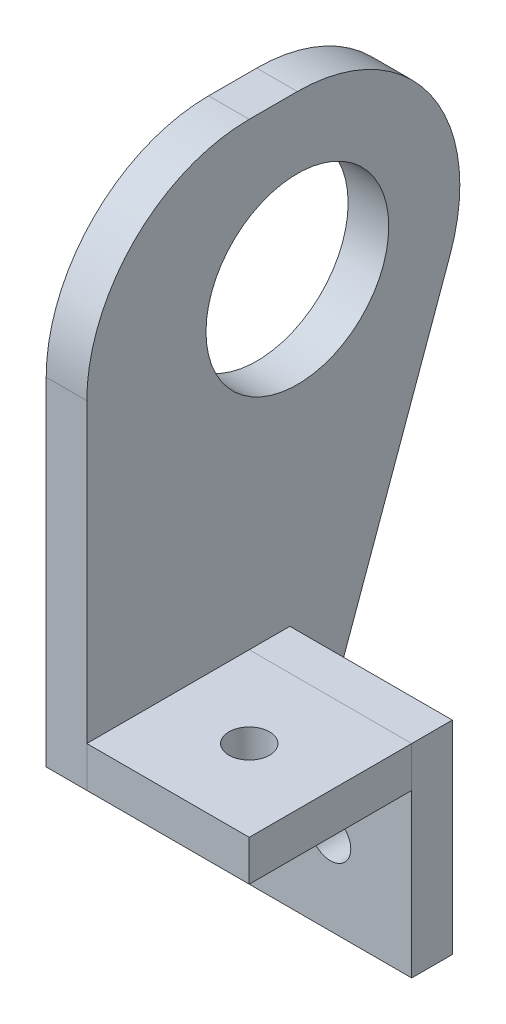
ISO-10303-21;
HEADER;
FILE_DESCRIPTION(('STEP AP214'),'2;1');
FILE_NAME('part.step','',(''),(''),'','','');
FILE_SCHEMA(('AUTOMOTIVE_DESIGN { 1 0 10303 214 1 1 1 1 }'));
ENDSEC;
DATA;
#1=APPLICATION_CONTEXT('core data for automotive mechanical design processes');
#2=APPLICATION_PROTOCOL_DEFINITION('international standard','automotive_design',2000,#1);
#3=PRODUCT_CONTEXT('',#1,'mechanical');
#4=PRODUCT('Part','Part','',(#3));
#5=PRODUCT_RELATED_PRODUCT_CATEGORY('part','',(#4));
#6=PRODUCT_DEFINITION_FORMATION('','',#4);
#7=PRODUCT_DEFINITION_CONTEXT('part definition',#1,'design');
#8=PRODUCT_DEFINITION('design','',#6,#7);
#9=PRODUCT_DEFINITION_SHAPE('','',#8);
#10=(LENGTH_UNIT() NAMED_UNIT(*) SI_UNIT(.MILLI.,.METRE.));
#11=(NAMED_UNIT(*) PLANE_ANGLE_UNIT() SI_UNIT($,.RADIAN.));
#12=(NAMED_UNIT(*) SI_UNIT($,.STERADIAN.) SOLID_ANGLE_UNIT());
#13=UNCERTAINTY_MEASURE_WITH_UNIT(LENGTH_MEASURE(1.E-05),#10,'distance_accuracy_value','');
#14=(GEOMETRIC_REPRESENTATION_CONTEXT(3) GLOBAL_UNCERTAINTY_ASSIGNED_CONTEXT((#13)) GLOBAL_UNIT_ASSIGNED_CONTEXT((#10,
#11,#12)) REPRESENTATION_CONTEXT('',''));
#15=CARTESIAN_POINT('',(0.,0.,0.));
#16=DIRECTION('',(0.,0.,1.));
#17=DIRECTION('',(1.,0.,0.));
#18=AXIS2_PLACEMENT_3D('',#15,#16,#17);
#19=CARTESIAN_POINT('',(31.75,-78.1749999999953,1.17499999999981));
#20=DIRECTION('',(0.,0.,1.));
#21=DIRECTION('',(1.,0.,0.));
#22=AXIS2_PLACEMENT_3D('',#19,#20,#21);
#23=PLANE('',#22);
#24=CARTESIAN_POINT('',(19.05,-65.4749999999953,1.17499999999981));
#25=DIRECTION('',(0.,0.,1.));
#26=DIRECTION('',(1.,0.,0.));
#27=AXIS2_PLACEMENT_3D('',#24,#25,#26);
#28=CIRCLE('',#27,3.175);
#29=CARTESIAN_POINT('',(22.225,-65.4749999999953,1.17499999999981));
#30=VERTEX_POINT('',#29);
#31=EDGE_CURVE('E113',#30,#30,#28,.T.);
#32=ORIENTED_EDGE('',*,*,#31,.T.);
#33=EDGE_LOOP('',(#32));
#34=FACE_BOUND('',#33,.T.);
#35=DIRECTION('',(0.,1.,0.));
#36=VECTOR('',#35,1.);
#37=CARTESIAN_POINT('',(6.35,-78.1749999999953,1.17499999999981));
#38=LINE('',#37,#36);
#39=CARTESIAN_POINT('',(6.35,-78.1749999999953,1.17499999999981));
#40=VERTEX_POINT('',#39);
#41=CARTESIAN_POINT('',(6.35,-46.4249999999953,1.17499999999981));
#42=VERTEX_POINT('',#41);
#43=EDGE_CURVE('E110',#40,#42,#38,.T.);
#44=ORIENTED_EDGE('',*,*,#43,.T.);
#45=DIRECTION('',(-1.,0.,0.));
#46=VECTOR('',#45,1.);
#47=CARTESIAN_POINT('',(31.75,-46.4249999999953,1.17499999999981));
#48=LINE('',#47,#46);
#49=CARTESIAN_POINT('',(31.75,-46.4249999999953,1.17499999999981));
#50=VERTEX_POINT('',#49);
#51=EDGE_CURVE('E12',#50,#42,#48,.T.);
#52=ORIENTED_EDGE('',*,*,#51,.F.);
#53=DIRECTION('',(0.,1.,0.));
#54=VECTOR('',#53,1.);
#55=CARTESIAN_POINT('',(31.75,-78.1749999999953,1.17499999999981));
#56=LINE('',#55,#54);
#57=CARTESIAN_POINT('',(31.75,-78.1749999999953,1.17499999999981));
#58=VERTEX_POINT('',#57);
#59=EDGE_CURVE('E98',#58,#50,#56,.T.);
#60=ORIENTED_EDGE('',*,*,#59,.F.);
#61=DIRECTION('',(-1.,0.,0.));
#62=VECTOR('',#61,1.);
#63=CARTESIAN_POINT('',(31.75,-78.1749999999953,1.17499999999981));
#64=LINE('',#63,#62);
#65=EDGE_CURVE('E106',#58,#40,#64,.T.);
#66=ORIENTED_EDGE('',*,*,#65,.T.);
#67=EDGE_LOOP('',(#44,#52,#60,#66));
#68=FACE_BOUND('',#67,.T.);
#69=ADVANCED_FACE('F47',(#34,#68),#23,.F.);
#70=CARTESIAN_POINT('',(31.75,-46.4249999999953,1.17499999999981));
#71=DIRECTION('',(0.,-1.,0.));
#72=DIRECTION('',(0.,0.,-1.));
#73=AXIS2_PLACEMENT_3D('',#70,#71,#72);
#74=PLANE('',#73);
#75=DIRECTION('',(0.,0.,1.));
#76=VECTOR('',#75,1.);
#77=CARTESIAN_POINT('',(6.35,-46.4249999999953,1.17499999999981));
#78=LINE('',#77,#76);
#79=CARTESIAN_POINT('',(6.35,-46.4249999999953,7.52499999999958));
#80=VERTEX_POINT('',#79);
#81=EDGE_CURVE('E102',#42,#80,#78,.T.);
#82=ORIENTED_EDGE('',*,*,#81,.T.);
#83=DIRECTION('',(-1.,0.,0.));
#84=VECTOR('',#83,1.);
#85=CARTESIAN_POINT('',(31.75,-46.4249999999953,7.52499999999958));
#86=LINE('',#85,#84);
#87=CARTESIAN_POINT('',(31.75,-46.4249999999953,7.52499999999958));
#88=VERTEX_POINT('',#87);
#89=EDGE_CURVE('E55',#88,#80,#86,.T.);
#90=ORIENTED_EDGE('',*,*,#89,.F.);
#91=DIRECTION('',(0.,0.,1.));
#92=VECTOR('',#91,1.);
#93=CARTESIAN_POINT('',(31.75,-46.4249999999953,1.17499999999981));
#94=LINE('',#93,#92);
#95=EDGE_CURVE('E93',#50,#88,#94,.T.);
#96=ORIENTED_EDGE('',*,*,#95,.F.);
#97=ORIENTED_EDGE('',*,*,#51,.T.);
#98=EDGE_LOOP('',(#82,#90,#96,#97));
#99=FACE_BOUND('',#98,.T.);
#100=ADVANCED_FACE('F101',(#99),#74,.F.);
#101=CARTESIAN_POINT('',(31.75,-78.1749999999953,7.52499999999958));
#102=DIRECTION('',(0.,0.,-1.));
#103=DIRECTION('',(-1.,0.,0.));
#104=AXIS2_PLACEMENT_3D('',#101,#102,#103);
#105=PLANE('',#104);
#106=CARTESIAN_POINT('',(19.05,-65.4749999999953,7.52499999999958));
#107=DIRECTION('',(0.,0.,1.));
#108=DIRECTION('',(1.,0.,0.));
#109=AXIS2_PLACEMENT_3D('',#106,#107,#108);
#110=CIRCLE('',#109,3.175);
#111=CARTESIAN_POINT('',(22.225,-65.4749999999953,7.52499999999958));
#112=VERTEX_POINT('',#111);
#113=EDGE_CURVE('E126',#112,#112,#110,.T.);
#114=ORIENTED_EDGE('',*,*,#113,.F.);
#115=EDGE_LOOP('',(#114));
#116=FACE_BOUND('',#115,.T.);
#117=DIRECTION('',(0.,-1.,0.));
#118=VECTOR('',#117,1.);
#119=CARTESIAN_POINT('',(6.35,-78.1749999999953,7.52499999999958));
#120=LINE('',#119,#118);
#121=CARTESIAN_POINT('',(6.35,-78.1749999999953,7.52499999999958));
#122=VERTEX_POINT('',#121);
#123=EDGE_CURVE('E80',#80,#122,#120,.T.);
#124=ORIENTED_EDGE('',*,*,#123,.T.);
#125=DIRECTION('',(-1.,0.,0.));
#126=VECTOR('',#125,1.);
#127=CARTESIAN_POINT('',(31.75,-78.1749999999953,7.52499999999958));
#128=LINE('',#127,#126);
#129=CARTESIAN_POINT('',(31.75,-78.1749999999953,7.52499999999958));
#130=VERTEX_POINT('',#129);
#131=EDGE_CURVE('E103',#130,#122,#128,.T.);
#132=ORIENTED_EDGE('',*,*,#131,.F.);
#133=DIRECTION('',(0.,-1.,0.));
#134=VECTOR('',#133,1.);
#135=CARTESIAN_POINT('',(31.75,-78.1749999999953,7.52499999999958));
#136=LINE('',#135,#134);
#137=EDGE_CURVE('E96',#88,#130,#136,.T.);
#138=ORIENTED_EDGE('',*,*,#137,.F.);
#139=ORIENTED_EDGE('',*,*,#89,.T.);
#140=EDGE_LOOP('',(#124,#132,#138,#139));
#141=FACE_BOUND('',#140,.T.);
#142=ADVANCED_FACE('F104',(#116,#141),#105,.F.);
#143=CARTESIAN_POINT('',(31.75,-78.1749999999953,1.17499999999981));
#144=DIRECTION('',(0.,1.,0.));
#145=DIRECTION('',(0.,0.,1.));
#146=AXIS2_PLACEMENT_3D('',#143,#144,#145);
#147=PLANE('',#146);
#148=DIRECTION('',(0.,0.,-1.));
#149=VECTOR('',#148,1.);
#150=CARTESIAN_POINT('',(6.35,-78.1749999999953,1.17499999999981));
#151=LINE('',#150,#149);
#152=EDGE_CURVE('E86',#122,#40,#151,.T.);
#153=ORIENTED_EDGE('',*,*,#152,.T.);
#154=ORIENTED_EDGE('',*,*,#65,.F.);
#155=DIRECTION('',(0.,0.,-1.));
#156=VECTOR('',#155,1.);
#157=CARTESIAN_POINT('',(31.75,-78.1749999999953,1.17499999999981));
#158=LINE('',#157,#156);
#159=EDGE_CURVE('E63',#130,#58,#158,.T.);
#160=ORIENTED_EDGE('',*,*,#159,.F.);
#161=ORIENTED_EDGE('',*,*,#131,.T.);
#162=EDGE_LOOP('',(#153,#154,#160,#161));
#163=FACE_BOUND('',#162,.T.);
#164=ADVANCED_FACE('F118',(#163),#147,.F.);
#165=CARTESIAN_POINT('',(31.75,0.,0.));
#166=DIRECTION('',(1.,0.,0.));
#167=DIRECTION('',(0.,0.,-1.));
#168=AXIS2_PLACEMENT_3D('',#165,#166,#167);
#169=PLANE('',#168);
#170=ORIENTED_EDGE('',*,*,#59,.T.);
#171=ORIENTED_EDGE('',*,*,#95,.T.);
#172=ORIENTED_EDGE('',*,*,#137,.T.);
#173=ORIENTED_EDGE('',*,*,#159,.T.);
#174=EDGE_LOOP('',(#170,#171,#172,#173));
#175=FACE_BOUND('',#174,.T.);
#176=ADVANCED_FACE('F94',(#175),#169,.T.);
#177=CARTESIAN_POINT('',(6.35,0.,0.));
#178=DIRECTION('',(1.,0.,0.));
#179=DIRECTION('',(0.,0.,-1.));
#180=AXIS2_PLACEMENT_3D('',#177,#178,#179);
#181=PLANE('',#180);
#182=ORIENTED_EDGE('',*,*,#43,.F.);
#183=ORIENTED_EDGE('',*,*,#152,.F.);
#184=ORIENTED_EDGE('',*,*,#123,.F.);
#185=ORIENTED_EDGE('',*,*,#81,.F.);
#186=EDGE_LOOP('',(#182,#183,#184,#185));
#187=FACE_BOUND('',#186,.T.);
#188=ADVANCED_FACE('F121',(#187),#181,.F.);
#189=CARTESIAN_POINT('',(19.05,-65.4749999999953,-25.4));
#190=DIRECTION('',(0.,0.,1.));
#191=DIRECTION('',(1.,0.,0.));
#192=AXIS2_PLACEMENT_3D('',#189,#190,#191);
#193=CYLINDRICAL_SURFACE('',#192,3.175);
#194=ORIENTED_EDGE('',*,*,#113,.T.);
#195=EDGE_LOOP('',(#194));
#196=FACE_BOUND('',#195,.T.);
#197=ORIENTED_EDGE('',*,*,#31,.F.);
#198=EDGE_LOOP('',(#197));
#199=FACE_BOUND('',#198,.T.);
#200=ADVANCED_FACE('F130',(#196,#199),#193,.F.);
#201=CLOSED_SHELL('',(#69,#100,#142,#164,#176,#188,#200));
#202=MANIFOLD_SOLID_BREP('B2',#201);
#203=CARTESIAN_POINT('',(31.75,-52.7749999999953,32.9249999999998));
#204=DIRECTION('',(0.,0.,-1.));
#205=DIRECTION('',(-1.,0.,0.));
#206=AXIS2_PLACEMENT_3D('',#203,#204,#205);
#207=PLANE('',#206);
#208=DIRECTION('',(0.,-1.,0.));
#209=VECTOR('',#208,1.);
#210=CARTESIAN_POINT('',(6.35,-52.7749999999953,32.9249999999998));
#211=LINE('',#210,#209);
#212=CARTESIAN_POINT('',(6.35,-46.4249999999953,32.9249999999998));
#213=VERTEX_POINT('',#212);
#214=CARTESIAN_POINT('',(6.35,-52.7749999999953,32.9249999999998));
#215=VERTEX_POINT('',#214);
#216=EDGE_CURVE('E251',#213,#215,#211,.T.);
#217=ORIENTED_EDGE('',*,*,#216,.T.);
#218=DIRECTION('',(-1.,0.,0.));
#219=VECTOR('',#218,1.);
#220=CARTESIAN_POINT('',(31.75,-52.7749999999953,32.9249999999998));
#221=LINE('',#220,#219);
#222=CARTESIAN_POINT('',(31.75,-52.7749999999953,32.9249999999998));
#223=VERTEX_POINT('',#222);
#224=EDGE_CURVE('E45',#223,#215,#221,.T.);
#225=ORIENTED_EDGE('',*,*,#224,.F.);
#226=DIRECTION('',(0.,-1.,0.));
#227=VECTOR('',#226,1.);
#228=CARTESIAN_POINT('',(31.75,-52.7749999999953,32.9249999999998));
#229=LINE('',#228,#227);
#230=CARTESIAN_POINT('',(31.75,-46.4249999999953,32.9249999999998));
#231=VERTEX_POINT('',#230);
#232=EDGE_CURVE('E238',#231,#223,#229,.T.);
#233=ORIENTED_EDGE('',*,*,#232,.F.);
#234=DIRECTION('',(-1.,0.,0.));
#235=VECTOR('',#234,1.);
#236=CARTESIAN_POINT('',(31.75,-46.4249999999953,32.9249999999998));
#237=LINE('',#236,#235);
#238=EDGE_CURVE('E247',#231,#213,#237,.T.);
#239=ORIENTED_EDGE('',*,*,#238,.T.);
#240=EDGE_LOOP('',(#217,#225,#233,#239));
#241=FACE_BOUND('',#240,.T.);
#242=ADVANCED_FACE('F186',(#241),#207,.F.);
#243=CARTESIAN_POINT('',(31.75,-52.7749999999953,32.9249999999998));
#244=DIRECTION('',(0.,1.,0.));
#245=DIRECTION('',(0.,0.,1.));
#246=AXIS2_PLACEMENT_3D('',#243,#244,#245);
#247=PLANE('',#246);
#248=CARTESIAN_POINT('',(19.05,-52.7749999999953,20.2249999999997));
#249=DIRECTION('',(0.,-1.,0.));
#250=DIRECTION('',(0.,0.,-1.));
#251=AXIS2_PLACEMENT_3D('',#248,#249,#250);
#252=CIRCLE('',#251,3.175);
#253=CARTESIAN_POINT('',(19.05,-52.7749999999953,17.0499999999997));
#254=VERTEX_POINT('',#253);
#255=EDGE_CURVE('E264',#254,#254,#252,.T.);
#256=ORIENTED_EDGE('',*,*,#255,.F.);
#257=EDGE_LOOP('',(#256));
#258=FACE_BOUND('',#257,.T.);
#259=DIRECTION('',(0.,0.,-1.));
#260=VECTOR('',#259,1.);
#261=CARTESIAN_POINT('',(6.35,-52.7749999999953,32.9249999999998));
#262=LINE('',#261,#260);
#263=CARTESIAN_POINT('',(6.35,-52.7749999999953,7.52499999999958));
#264=VERTEX_POINT('',#263);
#265=EDGE_CURVE('E242',#215,#264,#262,.T.);
#266=ORIENTED_EDGE('',*,*,#265,.T.);
#267=DIRECTION('',(-1.,0.,0.));
#268=VECTOR('',#267,1.);
#269=CARTESIAN_POINT('',(31.75,-52.7749999999953,7.52499999999958));
#270=LINE('',#269,#268);
#271=CARTESIAN_POINT('',(31.75,-52.7749999999953,7.52499999999958));
#272=VERTEX_POINT('',#271);
#273=EDGE_CURVE('E195',#272,#264,#270,.T.);
#274=ORIENTED_EDGE('',*,*,#273,.F.);
#275=DIRECTION('',(0.,0.,-1.));
#276=VECTOR('',#275,1.);
#277=CARTESIAN_POINT('',(31.75,-52.7749999999953,32.9249999999998));
#278=LINE('',#277,#276);
#279=EDGE_CURVE('E233',#223,#272,#278,.T.);
#280=ORIENTED_EDGE('',*,*,#279,.F.);
#281=ORIENTED_EDGE('',*,*,#224,.T.);
#282=EDGE_LOOP('',(#266,#274,#280,#281));
#283=FACE_BOUND('',#282,.T.);
#284=ADVANCED_FACE('F241',(#258,#283),#247,.F.);
#285=CARTESIAN_POINT('',(31.75,-52.7749999999953,7.52499999999958));
#286=DIRECTION('',(0.,0.,1.));
#287=DIRECTION('',(1.,0.,0.));
#288=AXIS2_PLACEMENT_3D('',#285,#286,#287);
#289=PLANE('',#288);
#290=DIRECTION('',(0.,1.,0.));
#291=VECTOR('',#290,1.);
#292=CARTESIAN_POINT('',(6.35,-52.7749999999953,7.52499999999958));
#293=LINE('',#292,#291);
#294=CARTESIAN_POINT('',(6.35,-46.4249999999953,7.52499999999958));
#295=VERTEX_POINT('',#294);
#296=EDGE_CURVE('E220',#264,#295,#293,.T.);
#297=ORIENTED_EDGE('',*,*,#296,.T.);
#298=DIRECTION('',(-1.,0.,0.));
#299=VECTOR('',#298,1.);
#300=CARTESIAN_POINT('',(31.75,-46.4249999999953,7.52499999999958));
#301=LINE('',#300,#299);
#302=CARTESIAN_POINT('',(31.75,-46.4249999999953,7.52499999999958));
#303=VERTEX_POINT('',#302);
#304=EDGE_CURVE('E243',#303,#295,#301,.T.);
#305=ORIENTED_EDGE('',*,*,#304,.F.);
#306=DIRECTION('',(0.,1.,0.));
#307=VECTOR('',#306,1.);
#308=CARTESIAN_POINT('',(31.75,-52.7749999999953,7.52499999999958));
#309=LINE('',#308,#307);
#310=EDGE_CURVE('E236',#272,#303,#309,.T.);
#311=ORIENTED_EDGE('',*,*,#310,.F.);
#312=ORIENTED_EDGE('',*,*,#273,.T.);
#313=EDGE_LOOP('',(#297,#305,#311,#312));
#314=FACE_BOUND('',#313,.T.);
#315=ADVANCED_FACE('F245',(#314),#289,.F.);
#316=CARTESIAN_POINT('',(31.75,-46.4249999999953,32.9249999999998));
#317=DIRECTION('',(0.,-1.,0.));
#318=DIRECTION('',(0.,0.,-1.));
#319=AXIS2_PLACEMENT_3D('',#316,#317,#318);
#320=PLANE('',#319);
#321=CARTESIAN_POINT('',(19.05,-46.4249999999953,20.2249999999997));
#322=DIRECTION('',(0.,-1.,0.));
#323=DIRECTION('',(0.,0.,-1.));
#324=AXIS2_PLACEMENT_3D('',#321,#322,#323);
#325=CIRCLE('',#324,3.175);
#326=CARTESIAN_POINT('',(19.05,-46.4249999999953,17.0499999999997));
#327=VERTEX_POINT('',#326);
#328=EDGE_CURVE('E189',#327,#327,#325,.T.);
#329=ORIENTED_EDGE('',*,*,#328,.T.);
#330=EDGE_LOOP('',(#329));
#331=FACE_BOUND('',#330,.T.);
#332=DIRECTION('',(0.,0.,1.));
#333=VECTOR('',#332,1.);
#334=CARTESIAN_POINT('',(6.35,-46.4249999999953,32.9249999999998));
#335=LINE('',#334,#333);
#336=EDGE_CURVE('E226',#295,#213,#335,.T.);
#337=ORIENTED_EDGE('',*,*,#336,.T.);
#338=ORIENTED_EDGE('',*,*,#238,.F.);
#339=DIRECTION('',(0.,0.,1.));
#340=VECTOR('',#339,1.);
#341=CARTESIAN_POINT('',(31.75,-46.4249999999953,32.9249999999998));
#342=LINE('',#341,#340);
#343=EDGE_CURVE('E203',#303,#231,#342,.T.);
#344=ORIENTED_EDGE('',*,*,#343,.F.);
#345=ORIENTED_EDGE('',*,*,#304,.T.);
#346=EDGE_LOOP('',(#337,#338,#344,#345));
#347=FACE_BOUND('',#346,.T.);
#348=ADVANCED_FACE('F258',(#331,#347),#320,.F.);
#349=CARTESIAN_POINT('',(31.75,0.,0.));
#350=DIRECTION('',(-1.,0.,0.));
#351=DIRECTION('',(0.,0.,1.));
#352=AXIS2_PLACEMENT_3D('',#349,#350,#351);
#353=PLANE('',#352);
#354=ORIENTED_EDGE('',*,*,#232,.T.);
#355=ORIENTED_EDGE('',*,*,#279,.T.);
#356=ORIENTED_EDGE('',*,*,#310,.T.);
#357=ORIENTED_EDGE('',*,*,#343,.T.);
#358=EDGE_LOOP('',(#354,#355,#356,#357));
#359=FACE_BOUND('',#358,.T.);
#360=ADVANCED_FACE('F234',(#359),#353,.F.);
#361=CARTESIAN_POINT('',(6.35,0.,0.));
#362=DIRECTION('',(-1.,0.,0.));
#363=DIRECTION('',(0.,0.,1.));
#364=AXIS2_PLACEMENT_3D('',#361,#362,#363);
#365=PLANE('',#364);
#366=ORIENTED_EDGE('',*,*,#216,.F.);
#367=ORIENTED_EDGE('',*,*,#336,.F.);
#368=ORIENTED_EDGE('',*,*,#296,.F.);
#369=ORIENTED_EDGE('',*,*,#265,.F.);
#370=EDGE_LOOP('',(#366,#367,#368,#369));
#371=FACE_BOUND('',#370,.T.);
#372=ADVANCED_FACE('F261',(#371),#365,.T.);
#373=CARTESIAN_POINT('',(19.05,25.4,20.2249999999997));
#374=DIRECTION('',(0.,-1.,0.));
#375=DIRECTION('',(0.,0.,-1.));
#376=AXIS2_PLACEMENT_3D('',#373,#374,#375);
#377=CYLINDRICAL_SURFACE('',#376,3.175);
#378=ORIENTED_EDGE('',*,*,#255,.T.);
#379=EDGE_LOOP('',(#378));
#380=FACE_BOUND('',#379,.T.);
#381=ORIENTED_EDGE('',*,*,#328,.F.);
#382=EDGE_LOOP('',(#381));
#383=FACE_BOUND('',#382,.T.);
#384=ADVANCED_FACE('F272',(#380,#383),#377,.F.);
#385=CLOSED_SHELL('',(#242,#284,#315,#348,#360,#372,#384));
#386=MANIFOLD_SOLID_BREP('B6',#385);
#387=CARTESIAN_POINT('',(6.35,-54.3624999999953,9.11249999999958));
#388=DIRECTION('',(1.,0.,0.));
#389=DIRECTION('',(0.,0.,-1.));
#390=AXIS2_PLACEMENT_3D('',#387,#388,#389);
#391=PLANE('',#390);
#392=DIRECTION('',(0.,0.,1.));
#393=VECTOR('',#392,1.);
#394=CARTESIAN_POINT('',(6.35,25.4,0.));
#395=LINE('',#394,#393);
#396=CARTESIAN_POINT('',(6.35,25.4,0.));
#397=VERTEX_POINT('',#396);
#398=CARTESIAN_POINT('',(6.35,25.4,7.52499999999982));
#399=VERTEX_POINT('',#398);
#400=EDGE_CURVE('E451',#397,#399,#395,.T.);
#401=ORIENTED_EDGE('',*,*,#400,.T.);
#402=CARTESIAN_POINT('',(6.35,0.,7.52499999999981));
#403=DIRECTION('',(1.,0.,0.));
#404=DIRECTION('',(0.,0.,-1.));
#405=AXIS2_PLACEMENT_3D('',#402,#403,#404);
#406=CIRCLE('',#405,25.4);
#407=CARTESIAN_POINT('',(6.35,0.,32.9249999999998));
#408=VERTEX_POINT('',#407);
#409=EDGE_CURVE('E184',#399,#408,#406,.T.);
#410=ORIENTED_EDGE('',*,*,#409,.T.);
#411=DIRECTION('',(0.,-1.,0.));
#412=VECTOR('',#411,1.);
#413=CARTESIAN_POINT('',(6.35,25.4,32.9249999999998));
#414=LINE('',#413,#412);
#415=CARTESIAN_POINT('',(6.35,-52.7749999999953,32.9249999999998));
#416=VERTEX_POINT('',#415);
#417=EDGE_CURVE('E449',#408,#416,#414,.T.);
#418=ORIENTED_EDGE('',*,*,#417,.T.);
#419=DIRECTION('',(0.,0.,-1.));
#420=VECTOR('',#419,1.);
#421=CARTESIAN_POINT('',(6.35,-52.7749999999953,9.11249999999959));
#422=LINE('',#421,#420);
#423=CARTESIAN_POINT('',(6.35,-52.7749999999953,9.11249999999959));
#424=VERTEX_POINT('',#423);
#425=EDGE_CURVE('E403',#416,#424,#422,.T.);
#426=ORIENTED_EDGE('',*,*,#425,.T.);
#427=CARTESIAN_POINT('',(6.35,-54.3624999999953,9.11249999999958));
#428=DIRECTION('',(-1.,0.,0.));
#429=DIRECTION('',(0.,0.,-1.));
#430=AXIS2_PLACEMENT_3D('',#427,#428,#429);
#431=CIRCLE('',#430,1.5875);
#432=CARTESIAN_POINT('',(6.35,-54.3624999999953,7.52499999999958));
#433=VERTEX_POINT('',#432);
#434=EDGE_CURVE('E398',#424,#433,#431,.T.);
#435=ORIENTED_EDGE('',*,*,#434,.T.);
#436=DIRECTION('',(0.,-1.,0.));
#437=VECTOR('',#436,1.);
#438=CARTESIAN_POINT('',(6.35,-78.1749999999953,7.52499999999958));
#439=LINE('',#438,#437);
#440=CARTESIAN_POINT('',(6.35,-78.1749999999953,7.52499999999958));
#441=VERTEX_POINT('',#440);
#442=EDGE_CURVE('E387',#433,#441,#439,.T.);
#443=ORIENTED_EDGE('',*,*,#442,.T.);
#444=DIRECTION('',(0.,0.,-1.));
#445=VECTOR('',#444,1.);
#446=CARTESIAN_POINT('',(6.35,-78.1749999999953,7.52499999999958));
#447=LINE('',#446,#445);
#448=CARTESIAN_POINT('',(6.35,-78.1749999999953,1.17499999999981));
#449=VERTEX_POINT('',#448);
#450=EDGE_CURVE('E397',#441,#449,#447,.T.);
#451=ORIENTED_EDGE('',*,*,#450,.T.);
#452=DIRECTION('',(0.,0.940767579632719,-0.339052151021041));
#453=VECTOR('',#452,1.);
#454=CARTESIAN_POINT('',(6.35,-78.1749999999953,1.17499999999981));
#455=LINE('',#454,#453);
#456=CARTESIAN_POINT('',(6.35,-8.61192463593444,-23.8954965226711));
#457=VERTEX_POINT('',#456);
#458=EDGE_CURVE('E455',#449,#457,#455,.T.);
#459=ORIENTED_EDGE('',*,*,#458,.T.);
#460=CARTESIAN_POINT('',(6.35,0.,0.));
#461=DIRECTION('',(1.,0.,0.));
#462=DIRECTION('',(0.,0.,-1.));
#463=AXIS2_PLACEMENT_3D('',#460,#461,#462);
#464=CIRCLE('',#463,25.4);
#465=EDGE_CURVE('E453',#457,#397,#464,.T.);
#466=ORIENTED_EDGE('',*,*,#465,.T.);
#467=EDGE_LOOP('',(#401,#410,#418,#426,#435,#443,#451,#459,#466));
#468=FACE_BOUND('',#467,.T.);
#469=CARTESIAN_POINT('',(6.35,0.,0.));
#470=DIRECTION('',(1.,0.,0.));
#471=DIRECTION('',(0.,0.,-1.));
#472=AXIS2_PLACEMENT_3D('',#469,#470,#471);
#473=CIRCLE('',#472,14.2875);
#474=CARTESIAN_POINT('',(6.35,0.,-14.2875));
#475=VERTEX_POINT('',#474);
#476=EDGE_CURVE('E447',#475,#475,#473,.T.);
#477=ORIENTED_EDGE('',*,*,#476,.F.);
#478=EDGE_LOOP('',(#477));
#479=FACE_BOUND('',#478,.T.);
#480=ADVANCED_FACE('F316',(#468,#479),#391,.T.);
#481=CARTESIAN_POINT('',(0.,-54.3624999999953,9.11249999999958));
#482=DIRECTION('',(1.,0.,0.));
#483=DIRECTION('',(0.,0.,-1.));
#484=AXIS2_PLACEMENT_3D('',#481,#482,#483);
#485=PLANE('',#484);
#486=DIRECTION('',(0.,-1.,0.));
#487=VECTOR('',#486,1.);
#488=CARTESIAN_POINT('',(0.,25.4,32.9249999999998));
#489=LINE('',#488,#487);
#490=CARTESIAN_POINT('',(0.,0.,32.9249999999998));
#491=VERTEX_POINT('',#490);
#492=CARTESIAN_POINT('',(0.,-52.7749999999953,32.9249999999998));
#493=VERTEX_POINT('',#492);
#494=EDGE_CURVE('E434',#491,#493,#489,.T.);
#495=ORIENTED_EDGE('',*,*,#494,.F.);
#496=CARTESIAN_POINT('',(0.,0.,7.52499999999981));
#497=DIRECTION('',(1.,0.,0.));
#498=DIRECTION('',(0.,0.,-1.));
#499=AXIS2_PLACEMENT_3D('',#496,#497,#498);
#500=CIRCLE('',#499,25.4);
#501=CARTESIAN_POINT('',(0.,25.4,7.52499999999982));
#502=VERTEX_POINT('',#501);
#503=EDGE_CURVE('E338',#491,#502,#500,.F.);
#504=ORIENTED_EDGE('',*,*,#503,.T.);
#505=DIRECTION('',(0.,0.,1.));
#506=VECTOR('',#505,1.);
#507=CARTESIAN_POINT('',(0.,25.4,0.));
#508=LINE('',#507,#506);
#509=CARTESIAN_POINT('',(0.,25.4,0.));
#510=VERTEX_POINT('',#509);
#511=EDGE_CURVE('E436',#510,#502,#508,.T.);
#512=ORIENTED_EDGE('',*,*,#511,.F.);
#513=CARTESIAN_POINT('',(0.,0.,0.));
#514=DIRECTION('',(1.,0.,0.));
#515=DIRECTION('',(0.,0.,-1.));
#516=AXIS2_PLACEMENT_3D('',#513,#514,#515);
#517=CIRCLE('',#516,25.4);
#518=CARTESIAN_POINT('',(0.,-8.61192463593444,-23.8954965226711));
#519=VERTEX_POINT('',#518);
#520=EDGE_CURVE('E438',#519,#510,#517,.T.);
#521=ORIENTED_EDGE('',*,*,#520,.F.);
#522=DIRECTION('',(0.,0.940767579632719,-0.339052151021041));
#523=VECTOR('',#522,1.);
#524=CARTESIAN_POINT('',(0.,-78.1749999999953,1.17499999999981));
#525=LINE('',#524,#523);
#526=CARTESIAN_POINT('',(0.,-78.1749999999953,1.17499999999981));
#527=VERTEX_POINT('',#526);
#528=EDGE_CURVE('E440',#527,#519,#525,.T.);
#529=ORIENTED_EDGE('',*,*,#528,.F.);
#530=DIRECTION('',(0.,0.,-1.));
#531=VECTOR('',#530,1.);
#532=CARTESIAN_POINT('',(0.,-78.1749999999953,7.52499999999958));
#533=LINE('',#532,#531);
#534=CARTESIAN_POINT('',(0.,-78.1749999999953,7.52499999999958));
#535=VERTEX_POINT('',#534);
#536=EDGE_CURVE('E442',#535,#527,#533,.T.);
#537=ORIENTED_EDGE('',*,*,#536,.F.);
#538=DIRECTION('',(0.,-1.,0.));
#539=VECTOR('',#538,1.);
#540=CARTESIAN_POINT('',(0.,-78.1749999999953,7.52499999999958));
#541=LINE('',#540,#539);
#542=CARTESIAN_POINT('',(0.,-54.3624999999953,7.52499999999958));
#543=VERTEX_POINT('',#542);
#544=EDGE_CURVE('E444',#543,#535,#541,.T.);
#545=ORIENTED_EDGE('',*,*,#544,.F.);
#546=CARTESIAN_POINT('',(0.,-54.3624999999953,9.11249999999958));
#547=DIRECTION('',(-1.,0.,0.));
#548=DIRECTION('',(0.,0.,-1.));
#549=AXIS2_PLACEMENT_3D('',#546,#547,#548);
#550=CIRCLE('',#549,1.5875);
#551=CARTESIAN_POINT('',(0.,-52.7749999999953,9.11249999999959));
#552=VERTEX_POINT('',#551);
#553=EDGE_CURVE('E411',#552,#543,#550,.T.);
#554=ORIENTED_EDGE('',*,*,#553,.F.);
#555=DIRECTION('',(0.,0.,-1.));
#556=VECTOR('',#555,1.);
#557=CARTESIAN_POINT('',(0.,-52.7749999999953,9.11249999999959));
#558=LINE('',#557,#556);
#559=EDGE_CURVE('E407',#493,#552,#558,.T.);
#560=ORIENTED_EDGE('',*,*,#559,.F.);
#561=EDGE_LOOP('',(#495,#504,#512,#521,#529,#537,#545,#554,#560));
#562=FACE_BOUND('',#561,.T.);
#563=CARTESIAN_POINT('',(0.,0.,0.));
#564=DIRECTION('',(1.,0.,0.));
#565=DIRECTION('',(0.,0.,-1.));
#566=AXIS2_PLACEMENT_3D('',#563,#564,#565);
#567=CIRCLE('',#566,14.2875);
#568=CARTESIAN_POINT('',(0.,0.,-14.2875));
#569=VERTEX_POINT('',#568);
#570=EDGE_CURVE('E458',#569,#569,#567,.T.);
#571=ORIENTED_EDGE('',*,*,#570,.T.);
#572=EDGE_LOOP('',(#571));
#573=FACE_BOUND('',#572,.T.);
#574=ADVANCED_FACE('F467',(#562,#573),#485,.F.);
#575=CARTESIAN_POINT('',(6.35,-54.3624999999953,9.11249999999958));
#576=DIRECTION('',(-1.,0.,0.));
#577=DIRECTION('',(0.,0.,1.));
#578=AXIS2_PLACEMENT_3D('',#575,#576,#577);
#579=CYLINDRICAL_SURFACE('',#578,1.5875);
#580=ORIENTED_EDGE('',*,*,#553,.T.);
#581=DIRECTION('',(-1.,0.,0.));
#582=VECTOR('',#581,1.);
#583=CARTESIAN_POINT('',(6.35,-54.3624999999953,7.52499999999958));
#584=LINE('',#583,#582);
#585=EDGE_CURVE('E391',#433,#543,#584,.T.);
#586=ORIENTED_EDGE('',*,*,#585,.F.);
#587=ORIENTED_EDGE('',*,*,#434,.F.);
#588=DIRECTION('',(-1.,0.,0.));
#589=VECTOR('',#588,1.);
#590=CARTESIAN_POINT('',(6.35,-52.7749999999953,9.11249999999959));
#591=LINE('',#590,#589);
#592=EDGE_CURVE('E431',#424,#552,#591,.T.);
#593=ORIENTED_EDGE('',*,*,#592,.T.);
#594=EDGE_LOOP('',(#580,#586,#587,#593));
#595=FACE_BOUND('',#594,.T.);
#596=ADVANCED_FACE('F409',(#595),#579,.F.);
#597=CARTESIAN_POINT('',(6.35,-78.1749999999953,7.52499999999958));
#598=DIRECTION('',(0.,0.,-1.));
#599=DIRECTION('',(0.,1.,0.));
#600=AXIS2_PLACEMENT_3D('',#597,#598,#599);
#601=PLANE('',#600);
#602=ORIENTED_EDGE('',*,*,#544,.T.);
#603=DIRECTION('',(-1.,0.,0.));
#604=VECTOR('',#603,1.);
#605=CARTESIAN_POINT('',(6.35,-78.1749999999953,7.52499999999958));
#606=LINE('',#605,#604);
#607=EDGE_CURVE('E394',#441,#535,#606,.T.);
#608=ORIENTED_EDGE('',*,*,#607,.F.);
#609=ORIENTED_EDGE('',*,*,#442,.F.);
#610=ORIENTED_EDGE('',*,*,#585,.T.);
#611=EDGE_LOOP('',(#602,#608,#609,#610));
#612=FACE_BOUND('',#611,.T.);
#613=ADVANCED_FACE('F389',(#612),#601,.F.);
#614=CARTESIAN_POINT('',(6.35,-78.1749999999953,7.52499999999958));
#615=DIRECTION('',(0.,1.,0.));
#616=DIRECTION('',(0.,0.,1.));
#617=AXIS2_PLACEMENT_3D('',#614,#615,#616);
#618=PLANE('',#617);
#619=ORIENTED_EDGE('',*,*,#536,.T.);
#620=DIRECTION('',(-1.,0.,0.));
#621=VECTOR('',#620,1.);
#622=CARTESIAN_POINT('',(6.35,-78.1749999999953,1.17499999999981));
#623=LINE('',#622,#621);
#624=EDGE_CURVE('E416',#449,#527,#623,.T.);
#625=ORIENTED_EDGE('',*,*,#624,.F.);
#626=ORIENTED_EDGE('',*,*,#450,.F.);
#627=ORIENTED_EDGE('',*,*,#607,.T.);
#628=EDGE_LOOP('',(#619,#625,#626,#627));
#629=FACE_BOUND('',#628,.T.);
#630=ADVANCED_FACE('F493',(#629),#618,.F.);
#631=CARTESIAN_POINT('',(6.35,-78.1749999999953,1.17499999999981));
#632=DIRECTION('',(0.,0.339052151021041,0.94076757963272));
#633=DIRECTION('',(0.,-0.94076757963272,0.339052151021041));
#634=AXIS2_PLACEMENT_3D('',#631,#632,#633);
#635=PLANE('',#634);
#636=ORIENTED_EDGE('',*,*,#528,.T.);
#637=DIRECTION('',(-1.,0.,0.));
#638=VECTOR('',#637,1.);
#639=CARTESIAN_POINT('',(6.35,-8.61192463593444,-23.8954965226711));
#640=LINE('',#639,#638);
#641=EDGE_CURVE('E422',#457,#519,#640,.T.);
#642=ORIENTED_EDGE('',*,*,#641,.F.);
#643=ORIENTED_EDGE('',*,*,#458,.F.);
#644=ORIENTED_EDGE('',*,*,#624,.T.);
#645=EDGE_LOOP('',(#636,#642,#643,#644));
#646=FACE_BOUND('',#645,.T.);
#647=ADVANCED_FACE('F489',(#646),#635,.F.);
#648=CARTESIAN_POINT('',(6.35,0.,0.));
#649=DIRECTION('',(-1.,0.,0.));
#650=DIRECTION('',(0.,0.,1.));
#651=AXIS2_PLACEMENT_3D('',#648,#649,#650);
#652=CYLINDRICAL_SURFACE('',#651,25.4);
#653=ORIENTED_EDGE('',*,*,#520,.T.);
#654=DIRECTION('',(-1.,0.,0.));
#655=VECTOR('',#654,1.);
#656=CARTESIAN_POINT('',(6.35,25.4,0.));
#657=LINE('',#656,#655);
#658=EDGE_CURVE('E425',#397,#510,#657,.T.);
#659=ORIENTED_EDGE('',*,*,#658,.F.);
#660=ORIENTED_EDGE('',*,*,#465,.F.);
#661=ORIENTED_EDGE('',*,*,#641,.T.);
#662=EDGE_LOOP('',(#653,#659,#660,#661));
#663=FACE_BOUND('',#662,.T.);
#664=ADVANCED_FACE('F486',(#663),#652,.T.);
#665=CARTESIAN_POINT('',(6.35,25.4,0.));
#666=DIRECTION('',(0.,-1.,0.));
#667=DIRECTION('',(0.,0.,-1.));
#668=AXIS2_PLACEMENT_3D('',#665,#666,#667);
#669=PLANE('',#668);
#670=ORIENTED_EDGE('',*,*,#511,.T.);
#671=DIRECTION('',(-1.,0.,0.));
#672=VECTOR('',#671,1.);
#673=CARTESIAN_POINT('',(6.35,25.4,7.52499999999982));
#674=LINE('',#673,#672);
#675=EDGE_CURVE('E324',#502,#399,#674,.F.);
#676=ORIENTED_EDGE('',*,*,#675,.T.);
#677=ORIENTED_EDGE('',*,*,#400,.F.);
#678=ORIENTED_EDGE('',*,*,#658,.T.);
#679=EDGE_LOOP('',(#670,#676,#677,#678));
#680=FACE_BOUND('',#679,.T.);
#681=ADVANCED_FACE('F482',(#680),#669,.F.);
#682=CARTESIAN_POINT('',(6.35,25.4,32.9249999999998));
#683=DIRECTION('',(0.,0.,-1.));
#684=DIRECTION('',(0.,1.,0.));
#685=AXIS2_PLACEMENT_3D('',#682,#683,#684);
#686=PLANE('',#685);
#687=ORIENTED_EDGE('',*,*,#417,.F.);
#688=DIRECTION('',(-1.,0.,0.));
#689=VECTOR('',#688,1.);
#690=CARTESIAN_POINT('',(6.35,0.,32.9249999999998));
#691=LINE('',#690,#689);
#692=EDGE_CURVE('E412',#408,#491,#691,.T.);
#693=ORIENTED_EDGE('',*,*,#692,.T.);
#694=ORIENTED_EDGE('',*,*,#494,.T.);
#695=DIRECTION('',(-1.,0.,0.));
#696=VECTOR('',#695,1.);
#697=CARTESIAN_POINT('',(6.35,-52.7749999999953,32.9249999999998));
#698=LINE('',#697,#696);
#699=EDGE_CURVE('E428',#416,#493,#698,.T.);
#700=ORIENTED_EDGE('',*,*,#699,.F.);
#701=EDGE_LOOP('',(#687,#693,#694,#700));
#702=FACE_BOUND('',#701,.T.);
#703=ADVANCED_FACE('F478',(#702),#686,.F.);
#704=CARTESIAN_POINT('',(6.35,-52.7749999999953,9.11249999999959));
#705=DIRECTION('',(0.,1.,0.));
#706=DIRECTION('',(0.,0.,1.));
#707=AXIS2_PLACEMENT_3D('',#704,#705,#706);
#708=PLANE('',#707);
#709=ORIENTED_EDGE('',*,*,#559,.T.);
#710=ORIENTED_EDGE('',*,*,#592,.F.);
#711=ORIENTED_EDGE('',*,*,#425,.F.);
#712=ORIENTED_EDGE('',*,*,#699,.T.);
#713=EDGE_LOOP('',(#709,#710,#711,#712));
#714=FACE_BOUND('',#713,.T.);
#715=ADVANCED_FACE('F475',(#714),#708,.F.);
#716=CARTESIAN_POINT('',(6.35,0.,0.));
#717=DIRECTION('',(-1.,0.,0.));
#718=DIRECTION('',(0.,0.,1.));
#719=AXIS2_PLACEMENT_3D('',#716,#717,#718);
#720=CYLINDRICAL_SURFACE('',#719,14.2875);
#721=ORIENTED_EDGE('',*,*,#476,.T.);
#722=EDGE_LOOP('',(#721));
#723=FACE_BOUND('',#722,.T.);
#724=ORIENTED_EDGE('',*,*,#570,.F.);
#725=EDGE_LOOP('',(#724));
#726=FACE_BOUND('',#725,.T.);
#727=ADVANCED_FACE('F464',(#723,#726),#720,.F.);
#728=CARTESIAN_POINT('',(6.35,0.,7.52499999999981));
#729=DIRECTION('',(-1.,0.,0.));
#730=DIRECTION('',(0.,0.,1.));
#731=AXIS2_PLACEMENT_3D('',#728,#729,#730);
#732=CYLINDRICAL_SURFACE('',#731,25.4);
#733=ORIENTED_EDGE('',*,*,#409,.F.);
#734=ORIENTED_EDGE('',*,*,#675,.F.);
#735=ORIENTED_EDGE('',*,*,#503,.F.);
#736=ORIENTED_EDGE('',*,*,#692,.F.);
#737=EDGE_LOOP('',(#733,#734,#735,#736));
#738=FACE_BOUND('',#737,.T.);
#739=ADVANCED_FACE('F318',(#738),#732,.T.);
#740=CLOSED_SHELL('',(#480,#574,#596,#613,#630,#647,#664,#681,#703,#715,#727,#739));
#741=MANIFOLD_SOLID_BREP('B39',#740);
#742=ADVANCED_BREP_SHAPE_REPRESENTATION('',(#18,#202,#386,#741),#14);
#743=SHAPE_DEFINITION_REPRESENTATION(#9,#742);
ENDSEC;
END-ISO-10303-21;
